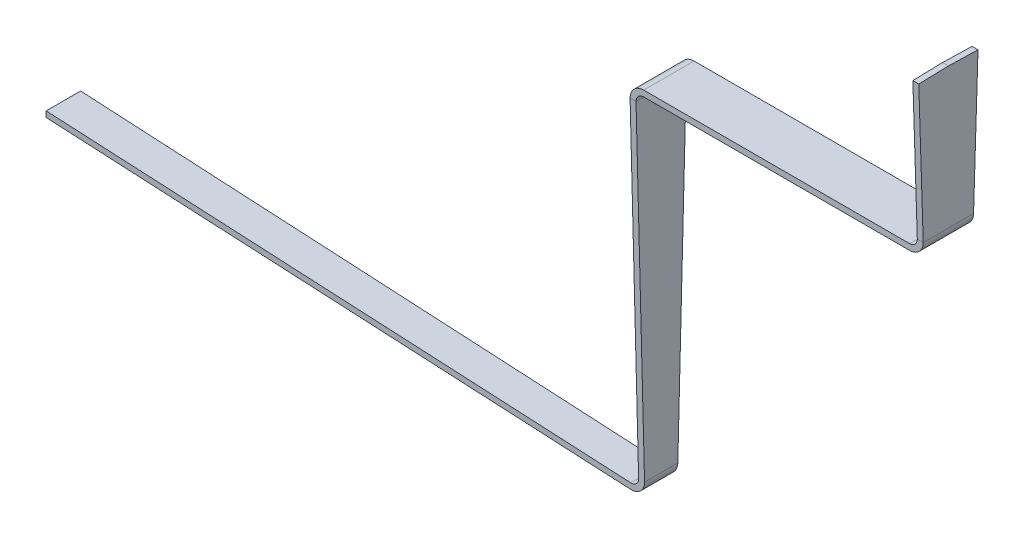
ISO-10303-21;
HEADER;
FILE_DESCRIPTION(('STEP AP214'),'2;1');
FILE_NAME('part.step','',(''),(''),'','','');
FILE_SCHEMA(('AUTOMOTIVE_DESIGN { 1 0 10303 214 1 1 1 1 }'));
ENDSEC;
DATA;
#1=APPLICATION_CONTEXT('core data for automotive mechanical design processes');
#2=APPLICATION_PROTOCOL_DEFINITION('international standard','automotive_design',2000,#1);
#3=PRODUCT_CONTEXT('',#1,'mechanical');
#4=PRODUCT('Part','Part','',(#3));
#5=PRODUCT_RELATED_PRODUCT_CATEGORY('part','',(#4));
#6=PRODUCT_DEFINITION_FORMATION('','',#4);
#7=PRODUCT_DEFINITION_CONTEXT('part definition',#1,'design');
#8=PRODUCT_DEFINITION('design','',#6,#7);
#9=PRODUCT_DEFINITION_SHAPE('','',#8);
#10=(LENGTH_UNIT() NAMED_UNIT(*) SI_UNIT(.MILLI.,.METRE.));
#11=(NAMED_UNIT(*) PLANE_ANGLE_UNIT() SI_UNIT($,.RADIAN.));
#12=(NAMED_UNIT(*) SI_UNIT($,.STERADIAN.) SOLID_ANGLE_UNIT());
#13=UNCERTAINTY_MEASURE_WITH_UNIT(LENGTH_MEASURE(1.E-05),#10,'distance_accuracy_value','');
#14=(GEOMETRIC_REPRESENTATION_CONTEXT(3) GLOBAL_UNCERTAINTY_ASSIGNED_CONTEXT((#13)) GLOBAL_UNIT_ASSIGNED_CONTEXT((#10,
#11,#12)) REPRESENTATION_CONTEXT('',''));
#15=CARTESIAN_POINT('',(0.,0.,0.));
#16=DIRECTION('',(0.,0.,1.));
#17=DIRECTION('',(1.,0.,0.));
#18=AXIS2_PLACEMENT_3D('',#15,#16,#17);
#19=CARTESIAN_POINT('',(0.,-52.,10.));
#20=DIRECTION('',(-1.,0.,0.));
#21=DIRECTION('',(0.,0.,1.));
#22=AXIS2_PLACEMENT_3D('',#19,#20,#21);
#23=PLANE('',#22);
#24=DIRECTION('',(0.,0.999494084538331,-0.0318052664331338));
#25=VECTOR('',#24,1.);
#26=CARTESIAN_POINT('',(0.,-0.261859215691798,-10.));
#27=LINE('',#26,#25);
#28=CARTESIAN_POINT('',(0.,-47.4,-8.50000000000001));
#29=VERTEX_POINT('',#28);
#30=CARTESIAN_POINT('',(0.,-0.261859215691798,-10.));
#31=VERTEX_POINT('',#30);
#32=EDGE_CURVE('E176',#29,#31,#27,.T.);
#33=ORIENTED_EDGE('',*,*,#32,.T.);
#34=DIRECTION('',(0.,0.0261769483078661,0.999657324975557));
#35=VECTOR('',#34,1.);
#36=CARTESIAN_POINT('',(0.,0.,0.));
#37=LINE('',#36,#35);
#38=CARTESIAN_POINT('',(0.,0.,0.));
#39=VERTEX_POINT('',#38);
#40=EDGE_CURVE('E180',#31,#39,#37,.T.);
#41=ORIENTED_EDGE('',*,*,#40,.T.);
#42=DIRECTION('',(0.,-0.0261769483078663,0.999657324975557));
#43=VECTOR('',#42,1.);
#44=CARTESIAN_POINT('',(0.,0.,0.));
#45=LINE('',#44,#43);
#46=CARTESIAN_POINT('',(0.,-0.261859215691801,10.));
#47=VERTEX_POINT('',#46);
#48=EDGE_CURVE('E159',#39,#47,#45,.T.);
#49=ORIENTED_EDGE('',*,*,#48,.T.);
#50=DIRECTION('',(0.,-0.999494084538331,-0.031805266433134));
#51=VECTOR('',#50,1.);
#52=CARTESIAN_POINT('',(0.,-0.261859215691801,10.));
#53=LINE('',#52,#51);
#54=CARTESIAN_POINT('',(0.,-47.4,8.49999999999999));
#55=VERTEX_POINT('',#54);
#56=EDGE_CURVE('E170',#47,#55,#53,.T.);
#57=ORIENTED_EDGE('',*,*,#56,.T.);
#58=DIRECTION('',(0.,0.,-1.));
#59=VECTOR('',#58,1.);
#60=CARTESIAN_POINT('',(0.,-47.4,10.));
#61=LINE('',#60,#59);
#62=EDGE_CURVE('E262',#55,#29,#61,.T.);
#63=ORIENTED_EDGE('',*,*,#62,.T.);
#64=EDGE_LOOP('',(#33,#41,#49,#57,#63));
#65=FACE_BOUND('',#64,.T.);
#66=ADVANCED_FACE('F36',(#65),#23,.F.);
#67=CARTESIAN_POINT('',(-2.,-52.,10.));
#68=DIRECTION('',(-1.,0.,0.));
#69=DIRECTION('',(0.,0.,1.));
#70=AXIS2_PLACEMENT_3D('',#67,#68,#69);
#71=PLANE('',#70);
#72=DIRECTION('',(0.,-0.0261769483078661,-0.999657324975557));
#73=VECTOR('',#72,1.);
#74=CARTESIAN_POINT('',(-2.,0.226047684833593,8.6324128114567));
#75=LINE('',#74,#73);
#76=CARTESIAN_POINT('',(-2.,0.,0.));
#77=VERTEX_POINT('',#76);
#78=CARTESIAN_POINT('',(-2.,-0.261859215691798,-10.));
#79=VERTEX_POINT('',#78);
#80=EDGE_CURVE('E12',#77,#79,#75,.T.);
#81=ORIENTED_EDGE('',*,*,#80,.T.);
#82=DIRECTION('',(0.,-0.999494084538332,0.0318052664331338));
#83=VECTOR('',#82,1.);
#84=CARTESIAN_POINT('',(-2.,-52.5834465047808,-8.33505565497909));
#85=LINE('',#84,#83);
#86=CARTESIAN_POINT('',(-2.,-47.4,-8.50000000000001));
#87=VERTEX_POINT('',#86);
#88=EDGE_CURVE('E225',#79,#87,#85,.T.);
#89=ORIENTED_EDGE('',*,*,#88,.T.);
#90=DIRECTION('',(0.,0.,-1.));
#91=VECTOR('',#90,1.);
#92=CARTESIAN_POINT('',(-2.,-47.4,10.));
#93=LINE('',#92,#91);
#94=CARTESIAN_POINT('',(-2.00000000000011,-47.4,8.49999999999999));
#95=VERTEX_POINT('',#94);
#96=EDGE_CURVE('E300',#95,#87,#93,.T.);
#97=ORIENTED_EDGE('',*,*,#96,.F.);
#98=DIRECTION('',(0.,0.999494084538332,0.031805266433134));
#99=VECTOR('',#98,1.);
#100=CARTESIAN_POINT('',(-2.,-51.9476629916391,8.35528715443674));
#101=LINE('',#100,#99);
#102=CARTESIAN_POINT('',(-2.,-0.261859215691801,10.));
#103=VERTEX_POINT('',#102);
#104=EDGE_CURVE('E198',#95,#103,#101,.T.);
#105=ORIENTED_EDGE('',*,*,#104,.T.);
#106=DIRECTION('',(0.,0.0261769483078663,-0.999657324975557));
#107=VECTOR('',#106,1.);
#108=CARTESIAN_POINT('',(-2.,-0.297311877595706,11.3538825360891));
#109=LINE('',#108,#107);
#110=EDGE_CURVE('E162',#103,#77,#109,.T.);
#111=ORIENTED_EDGE('',*,*,#110,.T.);
#112=EDGE_LOOP('',(#81,#89,#97,#105,#111));
#113=FACE_BOUND('',#112,.T.);
#114=ADVANCED_FACE('F323',(#113),#71,.T.);
#115=CARTESIAN_POINT('',(-4.6,-47.4,10.));
#116=DIRECTION('',(0.,0.,-1.));
#117=DIRECTION('',(-1.,0.,0.));
#118=AXIS2_PLACEMENT_3D('',#115,#116,#117);
#119=CYLINDRICAL_SURFACE('',#118,2.6);
#120=ORIENTED_EDGE('',*,*,#96,.T.);
#121=CARTESIAN_POINT('',(-4.6,-47.4,-8.50000000000001));
#122=DIRECTION('',(0.,0.,-1.));
#123=DIRECTION('',(0.,1.,0.));
#124=AXIS2_PLACEMENT_3D('',#121,#122,#123);
#125=CIRCLE('',#124,2.6);
#126=CARTESIAN_POINT('',(-4.59999999999999,-50.,-8.50000000000001));
#127=VERTEX_POINT('',#126);
#128=EDGE_CURVE('E222',#87,#127,#125,.T.);
#129=ORIENTED_EDGE('',*,*,#128,.T.);
#130=DIRECTION('',(0.,0.,-1.));
#131=VECTOR('',#130,1.);
#132=CARTESIAN_POINT('',(-4.59999999999999,-50.,10.));
#133=LINE('',#132,#131);
#134=CARTESIAN_POINT('',(-4.59999999999999,-50.,8.49999999999999));
#135=VERTEX_POINT('',#134);
#136=EDGE_CURVE('E297',#135,#127,#133,.T.);
#137=ORIENTED_EDGE('',*,*,#136,.F.);
#138=CARTESIAN_POINT('',(-4.6,-47.4,8.49999999999999));
#139=DIRECTION('',(0.,0.,1.));
#140=DIRECTION('',(0.,-1.,0.));
#141=AXIS2_PLACEMENT_3D('',#138,#139,#140);
#142=CIRCLE('',#141,2.6);
#143=EDGE_CURVE('E209',#135,#95,#142,.T.);
#144=ORIENTED_EDGE('',*,*,#143,.T.);
#145=EDGE_LOOP('',(#120,#129,#137,#144));
#146=FACE_BOUND('',#145,.T.);
#147=ADVANCED_FACE('F321',(#146),#119,.F.);
#148=CARTESIAN_POINT('',(-97.,-50.,10.));
#149=DIRECTION('',(0.,1.,0.));
#150=DIRECTION('',(-1.,0.,0.));
#151=AXIS2_PLACEMENT_3D('',#148,#149,#150);
#152=PLANE('',#151);
#153=ORIENTED_EDGE('',*,*,#136,.T.);
#154=DIRECTION('',(-1.,0.,0.));
#155=VECTOR('',#154,1.);
#156=CARTESIAN_POINT('',(-97.,-50.,-8.50000000000001));
#157=LINE('',#156,#155);
#158=CARTESIAN_POINT('',(-94.4,-50.,-8.50000000000001));
#159=VERTEX_POINT('',#158);
#160=EDGE_CURVE('E219',#127,#159,#157,.T.);
#161=ORIENTED_EDGE('',*,*,#160,.T.);
#162=DIRECTION('',(0.,0.,-1.));
#163=VECTOR('',#162,1.);
#164=CARTESIAN_POINT('',(-94.4,-50.,10.));
#165=LINE('',#164,#163);
#166=CARTESIAN_POINT('',(-94.4,-50.,8.49999999999999));
#167=VERTEX_POINT('',#166);
#168=EDGE_CURVE('E294',#167,#159,#165,.T.);
#169=ORIENTED_EDGE('',*,*,#168,.F.);
#170=DIRECTION('',(1.,0.,0.));
#171=VECTOR('',#170,1.);
#172=CARTESIAN_POINT('',(-97.,-50.,8.49999999999999));
#173=LINE('',#172,#171);
#174=EDGE_CURVE('E206',#167,#135,#173,.T.);
#175=ORIENTED_EDGE('',*,*,#174,.T.);
#176=EDGE_LOOP('',(#153,#161,#169,#175));
#177=FACE_BOUND('',#176,.T.);
#178=ADVANCED_FACE('F346',(#177),#152,.T.);
#179=CARTESIAN_POINT('',(-94.4,-54.6,10.));
#180=DIRECTION('',(0.,0.,-1.));
#181=DIRECTION('',(-1.,0.,0.));
#182=AXIS2_PLACEMENT_3D('',#179,#180,#181);
#183=CYLINDRICAL_SURFACE('',#182,4.6);
#184=ORIENTED_EDGE('',*,*,#168,.T.);
#185=CARTESIAN_POINT('',(-94.4,-54.6,-8.50000000000001));
#186=DIRECTION('',(0.,0.,-1.));
#187=DIRECTION('',(0.,1.,0.));
#188=AXIS2_PLACEMENT_3D('',#185,#186,#187);
#189=CIRCLE('',#188,4.6);
#190=CARTESIAN_POINT('',(-99.,-54.6,-8.50000000000001));
#191=VERTEX_POINT('',#190);
#192=EDGE_CURVE('E216',#159,#191,#189,.F.);
#193=ORIENTED_EDGE('',*,*,#192,.T.);
#194=DIRECTION('',(0.,0.,-1.));
#195=VECTOR('',#194,1.);
#196=CARTESIAN_POINT('',(-99.,-54.6,10.));
#197=LINE('',#196,#195);
#198=CARTESIAN_POINT('',(-99.,-54.6,8.49999999999999));
#199=VERTEX_POINT('',#198);
#200=EDGE_CURVE('E291',#199,#191,#197,.T.);
#201=ORIENTED_EDGE('',*,*,#200,.F.);
#202=CARTESIAN_POINT('',(-94.4,-54.6,8.49999999999999));
#203=DIRECTION('',(0.,0.,1.));
#204=DIRECTION('',(0.,-1.,0.));
#205=AXIS2_PLACEMENT_3D('',#202,#203,#204);
#206=CIRCLE('',#205,4.6);
#207=EDGE_CURVE('E203',#199,#167,#206,.F.);
#208=ORIENTED_EDGE('',*,*,#207,.T.);
#209=EDGE_LOOP('',(#184,#193,#201,#208));
#210=FACE_BOUND('',#209,.T.);
#211=ADVANCED_FACE('F351',(#210),#183,.T.);
#212=CARTESIAN_POINT('',(-99.,-172.253692716421,10.));
#213=DIRECTION('',(-1.,0.,0.));
#214=DIRECTION('',(0.,-1.,0.));
#215=AXIS2_PLACEMENT_3D('',#212,#213,#214);
#216=PLANE('',#215);
#217=ORIENTED_EDGE('',*,*,#200,.T.);
#218=DIRECTION('',(0.,-0.999673699999955,0.0255439528734369));
#219=VECTOR('',#218,1.);
#220=CARTESIAN_POINT('',(-99.,-172.649333374141,-5.48356913015734));
#221=LINE('',#220,#219);
#222=CARTESIAN_POINT('',(-99.,-167.406304140129,-5.61754053669496));
#223=VERTEX_POINT('',#222);
#224=EDGE_CURVE('E260',#191,#223,#221,.T.);
#225=ORIENTED_EDGE('',*,*,#224,.T.);
#226=DIRECTION('',(0.,0.,-1.));
#227=VECTOR('',#226,1.);
#228=CARTESIAN_POINT('',(-99.,-167.406304140129,10.));
#229=LINE('',#228,#227);
#230=CARTESIAN_POINT('',(-99.,-167.406304140129,5.61754053669492));
#231=VERTEX_POINT('',#230);
#232=EDGE_CURVE('E288',#231,#223,#229,.T.);
#233=ORIENTED_EDGE('',*,*,#232,.F.);
#234=DIRECTION('',(0.,0.999673699999955,0.0255439528734371));
#235=VECTOR('',#234,1.);
#236=CARTESIAN_POINT('',(-99.,-172.138621016509,5.4966190007253));
#237=LINE('',#236,#235);
#238=EDGE_CURVE('E243',#231,#199,#237,.T.);
#239=ORIENTED_EDGE('',*,*,#238,.T.);
#240=EDGE_LOOP('',(#217,#225,#233,#239));
#241=FACE_BOUND('',#240,.T.);
#242=ADVANCED_FACE('F355',(#241),#216,.T.);
#243=CARTESIAN_POINT('',(-101.6,-167.406304140129,10.));
#244=DIRECTION('',(0.,0.,-1.));
#245=DIRECTION('',(-1.,0.,0.));
#246=AXIS2_PLACEMENT_3D('',#243,#244,#245);
#247=CYLINDRICAL_SURFACE('',#246,2.6);
#248=ORIENTED_EDGE('',*,*,#232,.T.);
#249=CARTESIAN_POINT('',(-101.6,-167.406304140129,-5.61754053669496));
#250=DIRECTION('',(0.,-0.0255439528734369,-0.999673699999955));
#251=DIRECTION('',(0.,0.999673699999955,-0.0255439528734369));
#252=AXIS2_PLACEMENT_3D('',#249,#250,#251);
#253=ELLIPSE('',#252,2.60084865691687,2.6);
#254=CARTESIAN_POINT('',(-101.736073486232,-170.002740930491,-5.55119562933983));
#255=VERTEX_POINT('',#254);
#256=EDGE_CURVE('E58',#223,#255,#253,.T.);
#257=ORIENTED_EDGE('',*,*,#256,.T.);
#258=DIRECTION('',(0.,0.,-1.));
#259=VECTOR('',#258,1.);
#260=CARTESIAN_POINT('',(-101.736073486232,-170.002740930491,10.));
#261=LINE('',#260,#259);
#262=CARTESIAN_POINT('',(-101.736073486232,-170.002740930491,5.55119562933978));
#263=VERTEX_POINT('',#262);
#264=EDGE_CURVE('E285',#263,#255,#261,.T.);
#265=ORIENTED_EDGE('',*,*,#264,.F.);
#266=CARTESIAN_POINT('',(-101.6,-167.406304140129,5.61754053669492));
#267=DIRECTION('',(0.,-0.0255439528734371,0.999673699999955));
#268=DIRECTION('',(0.,-0.999673699999955,-0.0255439528734371));
#269=AXIS2_PLACEMENT_3D('',#266,#267,#268);
#270=ELLIPSE('',#269,2.60084865691687,2.6);
#271=EDGE_CURVE('E240',#263,#231,#270,.T.);
#272=ORIENTED_EDGE('',*,*,#271,.T.);
#273=EDGE_LOOP('',(#248,#257,#265,#272));
#274=FACE_BOUND('',#273,.T.);
#275=ADVANCED_FACE('F359',(#274),#247,.F.);
#276=CARTESIAN_POINT('',(-96.8953280875141,-170.256433646912,10.));
#277=DIRECTION('',(0.0523359562429403,0.998629534754574,0.));
#278=DIRECTION('',(-0.998629534754574,0.0523359562429403,0.));
#279=AXIS2_PLACEMENT_3D('',#276,#277,#278);
#280=PLANE('',#279);
#281=ORIENTED_EDGE('',*,*,#264,.T.);
#282=DIRECTION('',(-0.99862864179082,0.0523359094446929,-0.00133730236620585));
#283=VECTOR('',#282,1.);
#284=CARTESIAN_POINT('',(-96.8745686135401,-170.257521604842,-5.54468539951314));
#285=LINE('',#284,#283);
#286=CARTESIAN_POINT('',(-298.895328087514,-159.670062231739,-5.81521923798063));
#287=VERTEX_POINT('',#286);
#288=EDGE_CURVE('E256',#255,#287,#285,.T.);
#289=ORIENTED_EDGE('',*,*,#288,.T.);
#290=DIRECTION('',(0.,0.,-1.));
#291=VECTOR('',#290,1.);
#292=CARTESIAN_POINT('',(-298.895328087514,-159.670062231739,10.));
#293=LINE('',#292,#291);
#294=CARTESIAN_POINT('',(-298.895328087514,-159.670062231739,5.81521923798059));
#295=VERTEX_POINT('',#294);
#296=EDGE_CURVE('E282',#295,#287,#293,.T.);
#297=ORIENTED_EDGE('',*,*,#296,.F.);
#298=DIRECTION('',(0.99862864179082,-0.0523359094446929,-0.00133730236620586));
#299=VECTOR('',#298,1.);
#300=CARTESIAN_POINT('',(-96.9012779824526,-170.256121826132,5.54472116706547));
#301=LINE('',#300,#299);
#302=EDGE_CURVE('E237',#295,#263,#301,.T.);
#303=ORIENTED_EDGE('',*,*,#302,.T.);
#304=EDGE_LOOP('',(#281,#289,#297,#303));
#305=FACE_BOUND('',#304,.T.);
#306=ADVANCED_FACE('F363',(#305),#280,.T.);
#307=CARTESIAN_POINT('',(-299.,-161.667321301248,10.));
#308=DIRECTION('',(-0.998629534754576,0.0523359562429049,0.));
#309=DIRECTION('',(-0.0523359562429049,-0.998629534754576,0.));
#310=AXIS2_PLACEMENT_3D('',#307,#308,#309);
#311=PLANE('',#310);
#312=ORIENTED_EDGE('',*,*,#296,.T.);
#313=DIRECTION('',(-0.0523189257729573,-0.998304574029649,0.025508968568795));
#314=VECTOR('',#313,1.);
#315=CARTESIAN_POINT('',(-299.02103890979,-162.068767614706,-5.75392682100519));
#316=LINE('',#315,#314);
#317=CARTESIAN_POINT('',(-299.,-161.667321301248,-5.76418469386129));
#318=VERTEX_POINT('',#317);
#319=EDGE_CURVE('E253',#287,#318,#316,.T.);
#320=ORIENTED_EDGE('',*,*,#319,.T.);
#321=DIRECTION('',(0.,0.,-1.));
#322=VECTOR('',#321,1.);
#323=CARTESIAN_POINT('',(-299.,-161.667321301248,10.));
#324=LINE('',#323,#322);
#325=CARTESIAN_POINT('',(-299.,-161.667321301248,5.76418469386125));
#326=VERTEX_POINT('',#325);
#327=EDGE_CURVE('E279',#326,#318,#324,.T.);
#328=ORIENTED_EDGE('',*,*,#327,.F.);
#329=DIRECTION('',(0.0523189257729573,0.998304574029649,0.0255089685687952));
#330=VECTOR('',#329,1.);
#331=CARTESIAN_POINT('',(-298.994346873128,-161.559453214686,5.76694097055403));
#332=LINE('',#331,#330);
#333=EDGE_CURVE('E234',#326,#295,#332,.T.);
#334=ORIENTED_EDGE('',*,*,#333,.T.);
#335=EDGE_LOOP('',(#312,#320,#328,#334));
#336=FACE_BOUND('',#335,.T.);
#337=ADVANCED_FACE('F367',(#336),#311,.T.);
#338=CARTESIAN_POINT('',(-97.,-172.253692716421,10.));
#339=DIRECTION('',(0.0523359562429403,0.998629534754574,0.));
#340=DIRECTION('',(-0.998629534754574,0.0523359562429403,0.));
#341=AXIS2_PLACEMENT_3D('',#338,#339,#340);
#342=PLANE('',#341);
#343=DIRECTION('',(-0.99862864179082,0.0523359094446929,-0.00133730236620585));
#344=VECTOR('',#343,1.);
#345=CARTESIAN_POINT('',(-96.9793086810493,-172.254777102498,-5.49365094666284));
#346=LINE('',#345,#344);
#347=CARTESIAN_POINT('',(-101.840745398718,-172.,-5.50016108522049));
#348=VERTEX_POINT('',#347);
#349=EDGE_CURVE('E251',#348,#318,#346,.T.);
#350=ORIENTED_EDGE('',*,*,#349,.F.);
#351=DIRECTION('',(0.,0.,-1.));
#352=VECTOR('',#351,1.);
#353=CARTESIAN_POINT('',(-101.840745398718,-172.,10.));
#354=LINE('',#353,#352);
#355=CARTESIAN_POINT('',(-101.840745398718,-172.,5.50016108522045));
#356=VERTEX_POINT('',#355);
#357=EDGE_CURVE('E276',#356,#348,#354,.T.);
#358=ORIENTED_EDGE('',*,*,#357,.F.);
#359=DIRECTION('',(0.99862864179082,-0.0523359094446929,-0.00133730236620586));
#360=VECTOR('',#359,1.);
#361=CARTESIAN_POINT('',(-97.0060180499618,-172.253377323787,5.49368671421517));
#362=LINE('',#361,#360);
#363=EDGE_CURVE('E232',#326,#356,#362,.T.);
#364=ORIENTED_EDGE('',*,*,#363,.F.);
#365=ORIENTED_EDGE('',*,*,#327,.T.);
#366=EDGE_LOOP('',(#350,#358,#364,#365));
#367=FACE_BOUND('',#366,.T.);
#368=ADVANCED_FACE('F371',(#367),#342,.F.);
#369=CARTESIAN_POINT('',(-101.6,-167.406304140129,10.));
#370=DIRECTION('',(0.,0.,-1.));
#371=DIRECTION('',(-1.,0.,0.));
#372=AXIS2_PLACEMENT_3D('',#369,#370,#371);
#373=CYLINDRICAL_SURFACE('',#372,4.6);
#374=CARTESIAN_POINT('',(-101.6,-167.406304140129,-5.61754053669496));
#375=DIRECTION('',(0.,-0.0255439528734369,-0.999673699999955));
#376=DIRECTION('',(0.,0.999673699999955,-0.0255439528734369));
#377=AXIS2_PLACEMENT_3D('',#374,#375,#376);
#378=ELLIPSE('',#377,4.60150146992985,4.6);
#379=CARTESIAN_POINT('',(-97.,-167.406304140129,-5.61754053669496));
#380=VERTEX_POINT('',#379);
#381=EDGE_CURVE('E249',#380,#348,#378,.T.);
#382=ORIENTED_EDGE('',*,*,#381,.F.);
#383=DIRECTION('',(0.,0.,-1.));
#384=VECTOR('',#383,1.);
#385=CARTESIAN_POINT('',(-97.,-167.406304140129,10.));
#386=LINE('',#385,#384);
#387=CARTESIAN_POINT('',(-97.,-167.406304140129,5.61754053669492));
#388=VERTEX_POINT('',#387);
#389=EDGE_CURVE('E273',#388,#380,#386,.T.);
#390=ORIENTED_EDGE('',*,*,#389,.F.);
#391=CARTESIAN_POINT('',(-101.6,-167.406304140129,5.61754053669492));
#392=DIRECTION('',(0.,-0.0255439528734371,0.999673699999955));
#393=DIRECTION('',(0.,-0.999673699999955,-0.0255439528734371));
#394=AXIS2_PLACEMENT_3D('',#391,#392,#393);
#395=ELLIPSE('',#394,4.60150146992985,4.6);
#396=EDGE_CURVE('E230',#356,#388,#395,.T.);
#397=ORIENTED_EDGE('',*,*,#396,.F.);
#398=ORIENTED_EDGE('',*,*,#357,.T.);
#399=EDGE_LOOP('',(#382,#390,#397,#398));
#400=FACE_BOUND('',#399,.T.);
#401=ADVANCED_FACE('F375',(#400),#373,.T.);
#402=CARTESIAN_POINT('',(-97.,-172.253692716421,10.));
#403=DIRECTION('',(-1.,0.,0.));
#404=DIRECTION('',(0.,-1.,0.));
#405=AXIS2_PLACEMENT_3D('',#402,#403,#404);
#406=PLANE('',#405);
#407=DIRECTION('',(0.,-0.999673699999955,0.0255439528734369));
#408=VECTOR('',#407,1.);
#409=CARTESIAN_POINT('',(-97.,-172.649333374141,-5.48356913015734));
#410=LINE('',#409,#408);
#411=CARTESIAN_POINT('',(-97.,-54.6,-8.50000000000001));
#412=VERTEX_POINT('',#411);
#413=EDGE_CURVE('E246',#412,#380,#410,.T.);
#414=ORIENTED_EDGE('',*,*,#413,.F.);
#415=DIRECTION('',(0.,0.,-1.));
#416=VECTOR('',#415,1.);
#417=CARTESIAN_POINT('',(-97.,-54.6,10.));
#418=LINE('',#417,#416);
#419=CARTESIAN_POINT('',(-97.,-54.6,8.49999999999999));
#420=VERTEX_POINT('',#419);
#421=EDGE_CURVE('E270',#420,#412,#418,.T.);
#422=ORIENTED_EDGE('',*,*,#421,.F.);
#423=DIRECTION('',(0.,0.999673699999955,0.0255439528734371));
#424=VECTOR('',#423,1.);
#425=CARTESIAN_POINT('',(-97.,-172.138621016509,5.4966190007253));
#426=LINE('',#425,#424);
#427=EDGE_CURVE('E228',#388,#420,#426,.T.);
#428=ORIENTED_EDGE('',*,*,#427,.F.);
#429=ORIENTED_EDGE('',*,*,#389,.T.);
#430=EDGE_LOOP('',(#414,#422,#428,#429));
#431=FACE_BOUND('',#430,.T.);
#432=ADVANCED_FACE('F379',(#431),#406,.F.);
#433=CARTESIAN_POINT('',(-94.4,-54.6,10.));
#434=DIRECTION('',(0.,0.,-1.));
#435=DIRECTION('',(-1.,0.,0.));
#436=AXIS2_PLACEMENT_3D('',#433,#434,#435);
#437=CYLINDRICAL_SURFACE('',#436,2.6);
#438=CARTESIAN_POINT('',(-94.4,-54.6,-8.50000000000001));
#439=DIRECTION('',(0.,0.,-1.));
#440=DIRECTION('',(0.,1.,0.));
#441=AXIS2_PLACEMENT_3D('',#438,#439,#440);
#442=CIRCLE('',#441,2.6);
#443=CARTESIAN_POINT('',(-94.4,-52.,-8.50000000000001));
#444=VERTEX_POINT('',#443);
#445=EDGE_CURVE('E214',#444,#412,#442,.F.);
#446=ORIENTED_EDGE('',*,*,#445,.F.);
#447=DIRECTION('',(0.,0.,-1.));
#448=VECTOR('',#447,1.);
#449=CARTESIAN_POINT('',(-94.4,-52.,10.));
#450=LINE('',#449,#448);
#451=CARTESIAN_POINT('',(-94.4,-52.,8.49999999999999));
#452=VERTEX_POINT('',#451);
#453=EDGE_CURVE('E267',#452,#444,#450,.T.);
#454=ORIENTED_EDGE('',*,*,#453,.F.);
#455=CARTESIAN_POINT('',(-94.4,-54.6,8.49999999999999));
#456=DIRECTION('',(0.,0.,1.));
#457=DIRECTION('',(0.,-1.,0.));
#458=AXIS2_PLACEMENT_3D('',#455,#456,#457);
#459=CIRCLE('',#458,2.6);
#460=EDGE_CURVE('E201',#420,#452,#459,.F.);
#461=ORIENTED_EDGE('',*,*,#460,.F.);
#462=ORIENTED_EDGE('',*,*,#421,.T.);
#463=EDGE_LOOP('',(#446,#454,#461,#462));
#464=FACE_BOUND('',#463,.T.);
#465=ADVANCED_FACE('F383',(#464),#437,.F.);
#466=CARTESIAN_POINT('',(-97.,-52.,10.));
#467=DIRECTION('',(0.,1.,0.));
#468=DIRECTION('',(-1.,0.,0.));
#469=AXIS2_PLACEMENT_3D('',#466,#467,#468);
#470=PLANE('',#469);
#471=DIRECTION('',(-1.,0.,0.));
#472=VECTOR('',#471,1.);
#473=CARTESIAN_POINT('',(-97.,-52.,-8.50000000000001));
#474=LINE('',#473,#472);
#475=CARTESIAN_POINT('',(-4.59999999999999,-52.,-8.50000000000001));
#476=VERTEX_POINT('',#475);
#477=EDGE_CURVE('E212',#476,#444,#474,.T.);
#478=ORIENTED_EDGE('',*,*,#477,.F.);
#479=DIRECTION('',(0.,0.,-1.));
#480=VECTOR('',#479,1.);
#481=CARTESIAN_POINT('',(-4.59999999999999,-52.,10.));
#482=LINE('',#481,#480);
#483=CARTESIAN_POINT('',(-4.59999999999999,-52.,8.49999999999999));
#484=VERTEX_POINT('',#483);
#485=EDGE_CURVE('E264',#484,#476,#482,.T.);
#486=ORIENTED_EDGE('',*,*,#485,.F.);
#487=DIRECTION('',(1.,0.,0.));
#488=VECTOR('',#487,1.);
#489=CARTESIAN_POINT('',(-97.,-52.,8.49999999999999));
#490=LINE('',#489,#488);
#491=EDGE_CURVE('E50',#452,#484,#490,.T.);
#492=ORIENTED_EDGE('',*,*,#491,.F.);
#493=ORIENTED_EDGE('',*,*,#453,.T.);
#494=EDGE_LOOP('',(#478,#486,#492,#493));
#495=FACE_BOUND('',#494,.T.);
#496=ADVANCED_FACE('F314',(#495),#470,.F.);
#497=CARTESIAN_POINT('',(-4.6,-47.4,10.));
#498=DIRECTION('',(0.,0.,-1.));
#499=DIRECTION('',(-1.,0.,0.));
#500=AXIS2_PLACEMENT_3D('',#497,#498,#499);
#501=CYLINDRICAL_SURFACE('',#500,4.6);
#502=CARTESIAN_POINT('',(-4.6,-47.4,-8.50000000000001));
#503=DIRECTION('',(0.,0.,-1.));
#504=DIRECTION('',(0.,1.,0.));
#505=AXIS2_PLACEMENT_3D('',#502,#503,#504);
#506=CIRCLE('',#505,4.6);
#507=EDGE_CURVE('E43',#29,#476,#506,.T.);
#508=ORIENTED_EDGE('',*,*,#507,.F.);
#509=ORIENTED_EDGE('',*,*,#62,.F.);
#510=CARTESIAN_POINT('',(-4.6,-47.4,8.49999999999999));
#511=DIRECTION('',(0.,0.,1.));
#512=DIRECTION('',(0.,-1.,0.));
#513=AXIS2_PLACEMENT_3D('',#510,#511,#512);
#514=CIRCLE('',#513,4.6);
#515=EDGE_CURVE('E303',#484,#55,#514,.T.);
#516=ORIENTED_EDGE('',*,*,#515,.F.);
#517=ORIENTED_EDGE('',*,*,#485,.T.);
#518=EDGE_LOOP('',(#508,#509,#516,#517));
#519=FACE_BOUND('',#518,.T.);
#520=ADVANCED_FACE('F316',(#519),#501,.T.);
#521=CARTESIAN_POINT('',(-299.,-54.6,-8.50000000000001));
#522=DIRECTION('',(0.,-0.0255439528734369,-0.999673699999955));
#523=DIRECTION('',(0.,0.999673699999955,-0.0255439528734369));
#524=AXIS2_PLACEMENT_3D('',#521,#522,#523);
#525=PLANE('',#524);
#526=DIRECTION('',(1.,0.,0.));
#527=VECTOR('',#526,1.);
#528=CARTESIAN_POINT('',(-299.,-54.6,-8.50000000000001));
#529=LINE('',#528,#527);
#530=EDGE_CURVE('E189',#191,#412,#529,.T.);
#531=ORIENTED_EDGE('',*,*,#530,.T.);
#532=ORIENTED_EDGE('',*,*,#413,.T.);
#533=ORIENTED_EDGE('',*,*,#381,.T.);
#534=ORIENTED_EDGE('',*,*,#349,.T.);
#535=ORIENTED_EDGE('',*,*,#319,.F.);
#536=ORIENTED_EDGE('',*,*,#288,.F.);
#537=ORIENTED_EDGE('',*,*,#256,.F.);
#538=ORIENTED_EDGE('',*,*,#224,.F.);
#539=EDGE_LOOP('',(#531,#532,#533,#534,#535,#536,#537,#538));
#540=FACE_BOUND('',#539,.T.);
#541=ADVANCED_FACE('F390',(#540),#525,.T.);
#542=CARTESIAN_POINT('',(-299.,-54.6,8.49999999999999));
#543=DIRECTION('',(0.,-0.0255439528734371,0.999673699999955));
#544=DIRECTION('',(0.,-0.999673699999955,-0.0255439528734371));
#545=AXIS2_PLACEMENT_3D('',#542,#543,#544);
#546=PLANE('',#545);
#547=ORIENTED_EDGE('',*,*,#271,.F.);
#548=ORIENTED_EDGE('',*,*,#302,.F.);
#549=ORIENTED_EDGE('',*,*,#333,.F.);
#550=ORIENTED_EDGE('',*,*,#363,.T.);
#551=ORIENTED_EDGE('',*,*,#396,.T.);
#552=ORIENTED_EDGE('',*,*,#427,.T.);
#553=DIRECTION('',(1.,0.,0.));
#554=VECTOR('',#553,1.);
#555=CARTESIAN_POINT('',(-299.,-54.6,8.49999999999999));
#556=LINE('',#555,#554);
#557=EDGE_CURVE('E192',#199,#420,#556,.T.);
#558=ORIENTED_EDGE('',*,*,#557,.F.);
#559=ORIENTED_EDGE('',*,*,#238,.F.);
#560=EDGE_LOOP('',(#547,#548,#549,#550,#551,#552,#558,#559));
#561=FACE_BOUND('',#560,.T.);
#562=ADVANCED_FACE('F394',(#561),#546,.T.);
#563=CARTESIAN_POINT('',(-299.,-47.4,-8.50000000000001));
#564=DIRECTION('',(0.,0.,-1.));
#565=DIRECTION('',(0.,1.,0.));
#566=AXIS2_PLACEMENT_3D('',#563,#564,#565);
#567=PLANE('',#566);
#568=DIRECTION('',(1.,0.,0.));
#569=VECTOR('',#568,1.);
#570=CARTESIAN_POINT('',(-299.,-47.4,-8.50000000000001));
#571=LINE('',#570,#569);
#572=EDGE_CURVE('E187',#87,#29,#571,.T.);
#573=ORIENTED_EDGE('',*,*,#572,.T.);
#574=ORIENTED_EDGE('',*,*,#507,.T.);
#575=ORIENTED_EDGE('',*,*,#477,.T.);
#576=ORIENTED_EDGE('',*,*,#445,.T.);
#577=ORIENTED_EDGE('',*,*,#530,.F.);
#578=ORIENTED_EDGE('',*,*,#192,.F.);
#579=ORIENTED_EDGE('',*,*,#160,.F.);
#580=ORIENTED_EDGE('',*,*,#128,.F.);
#581=EDGE_LOOP('',(#573,#574,#575,#576,#577,#578,#579,#580));
#582=FACE_BOUND('',#581,.T.);
#583=ADVANCED_FACE('F307',(#582),#567,.T.);
#584=CARTESIAN_POINT('',(-299.,-47.4,8.49999999999999));
#585=DIRECTION('',(0.,0.,1.));
#586=DIRECTION('',(0.,-1.,0.));
#587=AXIS2_PLACEMENT_3D('',#584,#585,#586);
#588=PLANE('',#587);
#589=ORIENTED_EDGE('',*,*,#174,.F.);
#590=ORIENTED_EDGE('',*,*,#207,.F.);
#591=ORIENTED_EDGE('',*,*,#557,.T.);
#592=ORIENTED_EDGE('',*,*,#460,.T.);
#593=ORIENTED_EDGE('',*,*,#491,.T.);
#594=ORIENTED_EDGE('',*,*,#515,.T.);
#595=DIRECTION('',(1.,0.,0.));
#596=VECTOR('',#595,1.);
#597=CARTESIAN_POINT('',(-299.,-47.4,8.49999999999999));
#598=LINE('',#597,#596);
#599=EDGE_CURVE('E165',#95,#55,#598,.T.);
#600=ORIENTED_EDGE('',*,*,#599,.F.);
#601=ORIENTED_EDGE('',*,*,#143,.F.);
#602=EDGE_LOOP('',(#589,#590,#591,#592,#593,#594,#600,#601));
#603=FACE_BOUND('',#602,.T.);
#604=ADVANCED_FACE('F317',(#603),#588,.T.);
#605=CARTESIAN_POINT('',(-299.,0.,0.));
#606=DIRECTION('',(0.,0.999657324975557,-0.0261769483078661));
#607=DIRECTION('',(0.,0.0261769483078661,0.999657324975557));
#608=AXIS2_PLACEMENT_3D('',#605,#606,#607);
#609=PLANE('',#608);
#610=DIRECTION('',(1.,0.,0.));
#611=VECTOR('',#610,1.);
#612=CARTESIAN_POINT('',(-299.,0.,0.));
#613=LINE('',#612,#611);
#614=EDGE_CURVE('E166',#77,#39,#613,.T.);
#615=ORIENTED_EDGE('',*,*,#614,.T.);
#616=ORIENTED_EDGE('',*,*,#40,.F.);
#617=DIRECTION('',(1.,0.,0.));
#618=VECTOR('',#617,1.);
#619=CARTESIAN_POINT('',(-299.,-0.261859215691798,-10.));
#620=LINE('',#619,#618);
#621=EDGE_CURVE('E185',#79,#31,#620,.T.);
#622=ORIENTED_EDGE('',*,*,#621,.F.);
#623=ORIENTED_EDGE('',*,*,#80,.F.);
#624=EDGE_LOOP('',(#615,#616,#622,#623));
#625=FACE_BOUND('',#624,.T.);
#626=ADVANCED_FACE('F328',(#625),#609,.T.);
#627=CARTESIAN_POINT('',(-299.,-0.261859215691798,-10.));
#628=DIRECTION('',(0.,-0.0318052664331338,-0.999494084538331));
#629=DIRECTION('',(0.,0.999494084538332,-0.0318052664331338));
#630=AXIS2_PLACEMENT_3D('',#627,#628,#629);
#631=PLANE('',#630);
#632=ORIENTED_EDGE('',*,*,#621,.T.);
#633=ORIENTED_EDGE('',*,*,#32,.F.);
#634=ORIENTED_EDGE('',*,*,#572,.F.);
#635=ORIENTED_EDGE('',*,*,#88,.F.);
#636=EDGE_LOOP('',(#632,#633,#634,#635));
#637=FACE_BOUND('',#636,.T.);
#638=ADVANCED_FACE('F326',(#637),#631,.T.);
#639=CARTESIAN_POINT('',(-299.,-0.261859215691801,10.));
#640=DIRECTION('',(0.,-0.031805266433134,0.999494084538331));
#641=DIRECTION('',(0.,-0.999494084538332,-0.031805266433134));
#642=AXIS2_PLACEMENT_3D('',#639,#640,#641);
#643=PLANE('',#642);
#644=ORIENTED_EDGE('',*,*,#599,.T.);
#645=ORIENTED_EDGE('',*,*,#56,.F.);
#646=DIRECTION('',(1.,0.,0.));
#647=VECTOR('',#646,1.);
#648=CARTESIAN_POINT('',(-299.,-0.261859215691801,10.));
#649=LINE('',#648,#647);
#650=EDGE_CURVE('E154',#103,#47,#649,.T.);
#651=ORIENTED_EDGE('',*,*,#650,.F.);
#652=ORIENTED_EDGE('',*,*,#104,.F.);
#653=EDGE_LOOP('',(#644,#645,#651,#652));
#654=FACE_BOUND('',#653,.T.);
#655=ADVANCED_FACE('F171',(#654),#643,.T.);
#656=CARTESIAN_POINT('',(-299.,0.,0.));
#657=DIRECTION('',(0.,0.999657324975557,0.0261769483078663));
#658=DIRECTION('',(0.,-0.0261769483078663,0.999657324975557));
#659=AXIS2_PLACEMENT_3D('',#656,#657,#658);
#660=PLANE('',#659);
#661=ORIENTED_EDGE('',*,*,#650,.T.);
#662=ORIENTED_EDGE('',*,*,#48,.F.);
#663=ORIENTED_EDGE('',*,*,#614,.F.);
#664=ORIENTED_EDGE('',*,*,#110,.F.);
#665=EDGE_LOOP('',(#661,#662,#663,#664));
#666=FACE_BOUND('',#665,.T.);
#667=ADVANCED_FACE('F156',(#666),#660,.T.);
#668=CLOSED_SHELL('',(#66,#114,#147,#178,#211,#242,#275,#306,#337,#368,#401,#432,#465,#496,#520,
#541,#562,#583,#604,#626,#638,#655,#667));
#669=MANIFOLD_SOLID_BREP('B2',#668);
#670=ADVANCED_BREP_SHAPE_REPRESENTATION('',(#18,#669),#14);
#671=SHAPE_DEFINITION_REPRESENTATION(#9,#670);
ENDSEC;
END-ISO-10303-21;
